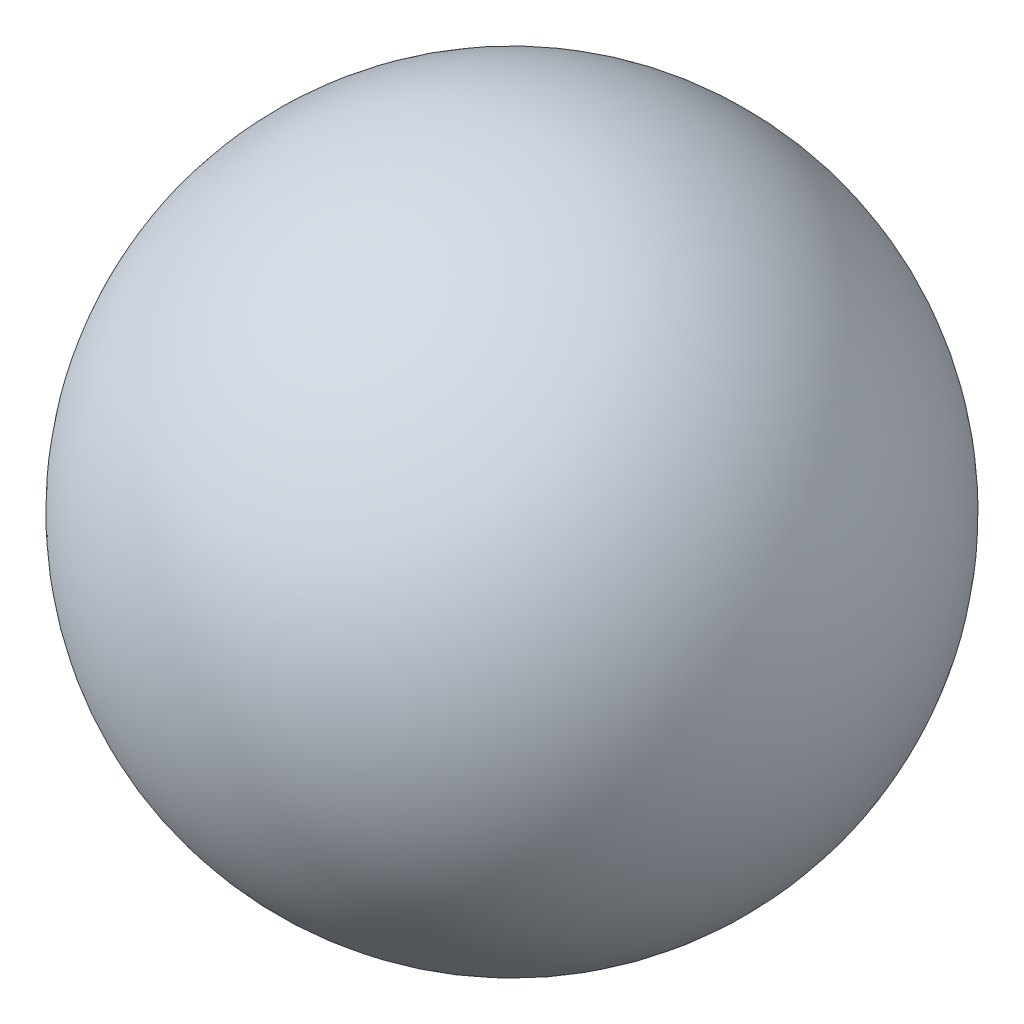
ISO-10303-21;
HEADER;
FILE_DESCRIPTION(('STEP AP214'),'2;1');
FILE_NAME('part.step','',(''),(''),'','','');
FILE_SCHEMA(('AUTOMOTIVE_DESIGN { 1 0 10303 214 1 1 1 1 }'));
ENDSEC;
DATA;
#1=APPLICATION_CONTEXT('core data for automotive mechanical design processes');
#2=APPLICATION_PROTOCOL_DEFINITION('international standard','automotive_design',2000,#1);
#3=PRODUCT_CONTEXT('',#1,'mechanical');
#4=PRODUCT('Part','Part','',(#3));
#5=PRODUCT_RELATED_PRODUCT_CATEGORY('part','',(#4));
#6=PRODUCT_DEFINITION_FORMATION('','',#4);
#7=PRODUCT_DEFINITION_CONTEXT('part definition',#1,'design');
#8=PRODUCT_DEFINITION('design','',#6,#7);
#9=PRODUCT_DEFINITION_SHAPE('','',#8);
#10=(LENGTH_UNIT() NAMED_UNIT(*) SI_UNIT(.MILLI.,.METRE.));
#11=(NAMED_UNIT(*) PLANE_ANGLE_UNIT() SI_UNIT($,.RADIAN.));
#12=(NAMED_UNIT(*) SI_UNIT($,.STERADIAN.) SOLID_ANGLE_UNIT());
#13=UNCERTAINTY_MEASURE_WITH_UNIT(LENGTH_MEASURE(1.E-05),#10,'distance_accuracy_value','');
#14=(GEOMETRIC_REPRESENTATION_CONTEXT(3) GLOBAL_UNCERTAINTY_ASSIGNED_CONTEXT((#13)) GLOBAL_UNIT_ASSIGNED_CONTEXT((#10,
#11,#12)) REPRESENTATION_CONTEXT('',''));
#15=CARTESIAN_POINT('',(0.,0.,0.));
#16=DIRECTION('',(0.,0.,1.));
#17=DIRECTION('',(1.,0.,0.));
#18=AXIS2_PLACEMENT_3D('',#15,#16,#17);
#19=CARTESIAN_POINT('',(-8.63786950002356,-23.5059572719803,0.));
#20=DIRECTION('',(-1.,0.,0.));
#21=DIRECTION('',(0.,1.,0.));
#22=AXIS2_PLACEMENT_3D('',#19,#20,#21);
#23=SPHERICAL_SURFACE('',#22,25.);
#24=CARTESIAN_POINT('',(-33.6378695000236,-23.5059572719803,0.));
#25=VERTEX_POINT('',#24);
#26=VERTEX_LOOP('',#25);
#27=FACE_BOUND('',#26,.T.);
#28=ADVANCED_FACE('F31',(#27),#23,.T.);
#29=CLOSED_SHELL('',(#28));
#30=MANIFOLD_SOLID_BREP('B2',#29);
#31=ADVANCED_BREP_SHAPE_REPRESENTATION('',(#18,#30),#14);
#32=SHAPE_DEFINITION_REPRESENTATION(#9,#31);
ENDSEC;
END-ISO-10303-21;
